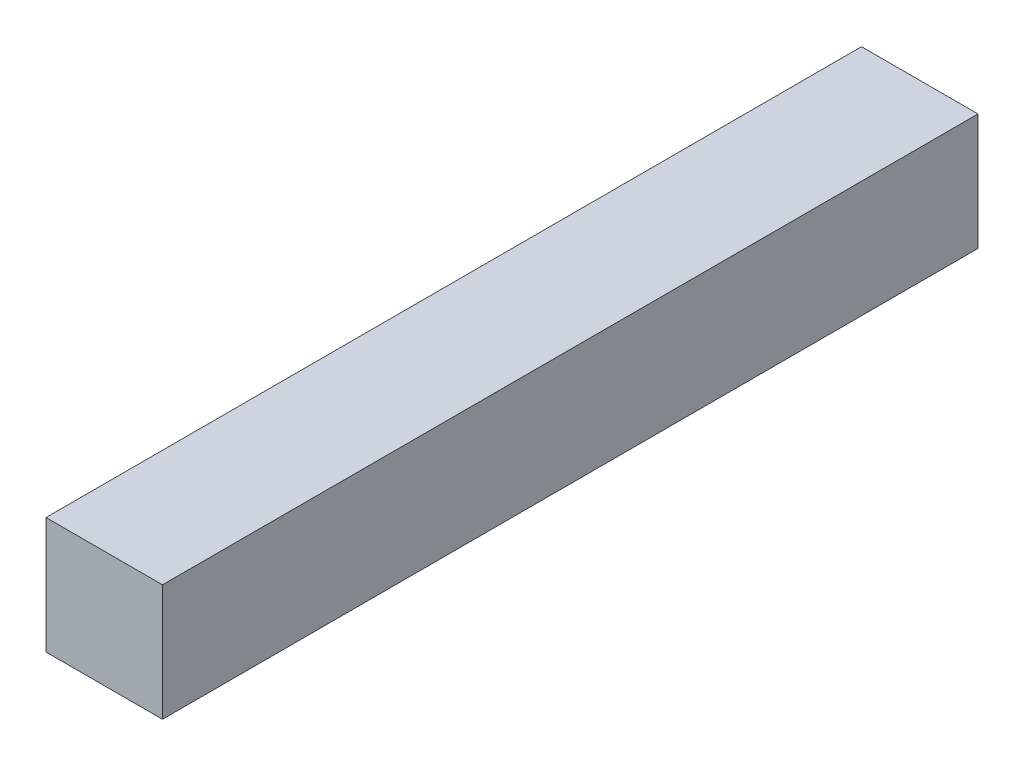
ISO-10303-21;
HEADER;
FILE_DESCRIPTION(('STEP AP214'),'2;1');
FILE_NAME('part.step','',(''),(''),'','','');
FILE_SCHEMA(('AUTOMOTIVE_DESIGN { 1 0 10303 214 1 1 1 1 }'));
ENDSEC;
DATA;
#1=APPLICATION_CONTEXT('core data for automotive mechanical design processes');
#2=APPLICATION_PROTOCOL_DEFINITION('international standard','automotive_design',2000,#1);
#3=PRODUCT_CONTEXT('',#1,'mechanical');
#4=PRODUCT('Part','Part','',(#3));
#5=PRODUCT_RELATED_PRODUCT_CATEGORY('part','',(#4));
#6=PRODUCT_DEFINITION_FORMATION('','',#4);
#7=PRODUCT_DEFINITION_CONTEXT('part definition',#1,'design');
#8=PRODUCT_DEFINITION('design','',#6,#7);
#9=PRODUCT_DEFINITION_SHAPE('','',#8);
#10=(LENGTH_UNIT() NAMED_UNIT(*) SI_UNIT(.MILLI.,.METRE.));
#11=(NAMED_UNIT(*) PLANE_ANGLE_UNIT() SI_UNIT($,.RADIAN.));
#12=(NAMED_UNIT(*) SI_UNIT($,.STERADIAN.) SOLID_ANGLE_UNIT());
#13=UNCERTAINTY_MEASURE_WITH_UNIT(LENGTH_MEASURE(1.E-05),#10,'distance_accuracy_value','');
#14=(GEOMETRIC_REPRESENTATION_CONTEXT(3) GLOBAL_UNCERTAINTY_ASSIGNED_CONTEXT((#13)) GLOBAL_UNIT_ASSIGNED_CONTEXT((#10,
#11,#12)) REPRESENTATION_CONTEXT('',''));
#15=CARTESIAN_POINT('',(0.,0.,0.));
#16=DIRECTION('',(0.,0.,1.));
#17=DIRECTION('',(1.,0.,0.));
#18=AXIS2_PLACEMENT_3D('',#15,#16,#17);
#19=CARTESIAN_POINT('',(0.508,-0.508,0.));
#20=DIRECTION('',(-1.,0.,0.));
#21=DIRECTION('',(0.,0.,1.));
#22=AXIS2_PLACEMENT_3D('',#19,#20,#21);
#23=PLANE('',#22);
#24=DIRECTION('',(0.,0.,-1.));
#25=VECTOR('',#24,1.);
#26=CARTESIAN_POINT('',(0.508,0.508,0.));
#27=LINE('',#26,#25);
#28=CARTESIAN_POINT('',(0.508,0.508,0.));
#29=VERTEX_POINT('',#28);
#30=CARTESIAN_POINT('',(0.508,0.508,7.112));
#31=VERTEX_POINT('',#30);
#32=EDGE_CURVE('E58',#29,#31,#27,.F.);
#33=ORIENTED_EDGE('',*,*,#32,.T.);
#34=DIRECTION('',(0.,1.,0.));
#35=VECTOR('',#34,1.);
#36=CARTESIAN_POINT('',(0.508,0.508,7.112));
#37=LINE('',#36,#35);
#38=CARTESIAN_POINT('',(0.508,-0.508,7.112));
#39=VERTEX_POINT('',#38);
#40=EDGE_CURVE('E55',#31,#39,#37,.F.);
#41=ORIENTED_EDGE('',*,*,#40,.T.);
#42=DIRECTION('',(0.,0.,1.));
#43=VECTOR('',#42,1.);
#44=CARTESIAN_POINT('',(0.508,-0.508,0.));
#45=LINE('',#44,#43);
#46=CARTESIAN_POINT('',(0.508,-0.508,0.));
#47=VERTEX_POINT('',#46);
#48=EDGE_CURVE('E77',#39,#47,#45,.F.);
#49=ORIENTED_EDGE('',*,*,#48,.T.);
#50=DIRECTION('',(0.,1.,0.));
#51=VECTOR('',#50,1.);
#52=CARTESIAN_POINT('',(0.508,-0.508,0.));
#53=LINE('',#52,#51);
#54=EDGE_CURVE('E20',#29,#47,#53,.F.);
#55=ORIENTED_EDGE('',*,*,#54,.F.);
#56=EDGE_LOOP('',(#33,#41,#49,#55));
#57=FACE_BOUND('',#56,.T.);
#58=ADVANCED_FACE('F17',(#57),#23,.F.);
#59=CARTESIAN_POINT('',(0.508,0.508,0.));
#60=DIRECTION('',(0.,-1.,0.));
#61=DIRECTION('',(0.,0.,-1.));
#62=AXIS2_PLACEMENT_3D('',#59,#60,#61);
#63=PLANE('',#62);
#64=DIRECTION('',(0.,0.,-1.));
#65=VECTOR('',#64,1.);
#66=CARTESIAN_POINT('',(-0.508,0.508,0.));
#67=LINE('',#66,#65);
#68=CARTESIAN_POINT('',(-0.508,0.508,0.));
#69=VERTEX_POINT('',#68);
#70=CARTESIAN_POINT('',(-0.508,0.508,7.112));
#71=VERTEX_POINT('',#70);
#72=EDGE_CURVE('E73',#69,#71,#67,.F.);
#73=ORIENTED_EDGE('',*,*,#72,.T.);
#74=DIRECTION('',(-1.,0.,0.));
#75=VECTOR('',#74,1.);
#76=CARTESIAN_POINT('',(-0.508,0.508,7.112));
#77=LINE('',#76,#75);
#78=EDGE_CURVE('E63',#71,#31,#77,.F.);
#79=ORIENTED_EDGE('',*,*,#78,.T.);
#80=ORIENTED_EDGE('',*,*,#32,.F.);
#81=DIRECTION('',(-1.,0.,0.));
#82=VECTOR('',#81,1.);
#83=CARTESIAN_POINT('',(-0.508,0.508,0.));
#84=LINE('',#83,#82);
#85=EDGE_CURVE('E79',#69,#29,#84,.F.);
#86=ORIENTED_EDGE('',*,*,#85,.F.);
#87=EDGE_LOOP('',(#73,#79,#80,#86));
#88=FACE_BOUND('',#87,.T.);
#89=ADVANCED_FACE('F72',(#88),#63,.F.);
#90=CARTESIAN_POINT('',(-0.508,0.508,7.112));
#91=DIRECTION('',(0.,0.,-1.));
#92=DIRECTION('',(-1.,0.,0.));
#93=AXIS2_PLACEMENT_3D('',#90,#91,#92);
#94=PLANE('',#93);
#95=DIRECTION('',(1.,0.,0.));
#96=VECTOR('',#95,1.);
#97=CARTESIAN_POINT('',(-0.508,-0.508,7.112));
#98=LINE('',#97,#96);
#99=CARTESIAN_POINT('',(-0.508,-0.508,7.112));
#100=VERTEX_POINT('',#99);
#101=EDGE_CURVE('E69',#100,#39,#98,.T.);
#102=ORIENTED_EDGE('',*,*,#101,.T.);
#103=ORIENTED_EDGE('',*,*,#40,.F.);
#104=ORIENTED_EDGE('',*,*,#78,.F.);
#105=DIRECTION('',(0.,1.,0.));
#106=VECTOR('',#105,1.);
#107=CARTESIAN_POINT('',(-0.508,0.508,7.112));
#108=LINE('',#107,#106);
#109=EDGE_CURVE('E83',#71,#100,#108,.F.);
#110=ORIENTED_EDGE('',*,*,#109,.T.);
#111=EDGE_LOOP('',(#102,#103,#104,#110));
#112=FACE_BOUND('',#111,.T.);
#113=ADVANCED_FACE('F66',(#112),#94,.F.);
#114=CARTESIAN_POINT('',(-0.508,-0.508,0.));
#115=DIRECTION('',(0.,1.,0.));
#116=DIRECTION('',(0.,0.,1.));
#117=AXIS2_PLACEMENT_3D('',#114,#115,#116);
#118=PLANE('',#117);
#119=ORIENTED_EDGE('',*,*,#48,.F.);
#120=ORIENTED_EDGE('',*,*,#101,.F.);
#121=DIRECTION('',(0.,0.,-1.));
#122=VECTOR('',#121,1.);
#123=CARTESIAN_POINT('',(-0.508,-0.508,0.));
#124=LINE('',#123,#122);
#125=CARTESIAN_POINT('',(-0.508,-0.508,0.));
#126=VERTEX_POINT('',#125);
#127=EDGE_CURVE('E26',#100,#126,#124,.T.);
#128=ORIENTED_EDGE('',*,*,#127,.T.);
#129=DIRECTION('',(-1.,0.,0.));
#130=VECTOR('',#129,1.);
#131=CARTESIAN_POINT('',(-0.508,-0.508,0.));
#132=LINE('',#131,#130);
#133=EDGE_CURVE('E34',#47,#126,#132,.T.);
#134=ORIENTED_EDGE('',*,*,#133,.F.);
#135=EDGE_LOOP('',(#119,#120,#128,#134));
#136=FACE_BOUND('',#135,.T.);
#137=ADVANCED_FACE('F88',(#136),#118,.F.);
#138=CARTESIAN_POINT('',(-0.508,0.508,0.));
#139=DIRECTION('',(0.,0.,-1.));
#140=DIRECTION('',(-1.,0.,0.));
#141=AXIS2_PLACEMENT_3D('',#138,#139,#140);
#142=PLANE('',#141);
#143=ORIENTED_EDGE('',*,*,#133,.T.);
#144=DIRECTION('',(0.,1.,0.));
#145=VECTOR('',#144,1.);
#146=CARTESIAN_POINT('',(-0.508,0.508,0.));
#147=LINE('',#146,#145);
#148=EDGE_CURVE('E11',#126,#69,#147,.T.);
#149=ORIENTED_EDGE('',*,*,#148,.T.);
#150=ORIENTED_EDGE('',*,*,#85,.T.);
#151=ORIENTED_EDGE('',*,*,#54,.T.);
#152=EDGE_LOOP('',(#143,#149,#150,#151));
#153=FACE_BOUND('',#152,.T.);
#154=ADVANCED_FACE('F91',(#153),#142,.T.);
#155=CARTESIAN_POINT('',(-0.508,0.508,0.));
#156=DIRECTION('',(1.,0.,0.));
#157=DIRECTION('',(0.,0.,-1.));
#158=AXIS2_PLACEMENT_3D('',#155,#156,#157);
#159=PLANE('',#158);
#160=ORIENTED_EDGE('',*,*,#127,.F.);
#161=ORIENTED_EDGE('',*,*,#109,.F.);
#162=ORIENTED_EDGE('',*,*,#72,.F.);
#163=ORIENTED_EDGE('',*,*,#148,.F.);
#164=EDGE_LOOP('',(#160,#161,#162,#163));
#165=FACE_BOUND('',#164,.T.);
#166=ADVANCED_FACE('F90',(#165),#159,.F.);
#167=CLOSED_SHELL('',(#58,#89,#113,#137,#154,#166));
#168=MANIFOLD_SOLID_BREP('B1',#167);
#169=ADVANCED_BREP_SHAPE_REPRESENTATION('',(#18,#168),#14);
#170=SHAPE_DEFINITION_REPRESENTATION(#9,#169);
ENDSEC;
END-ISO-10303-21;
